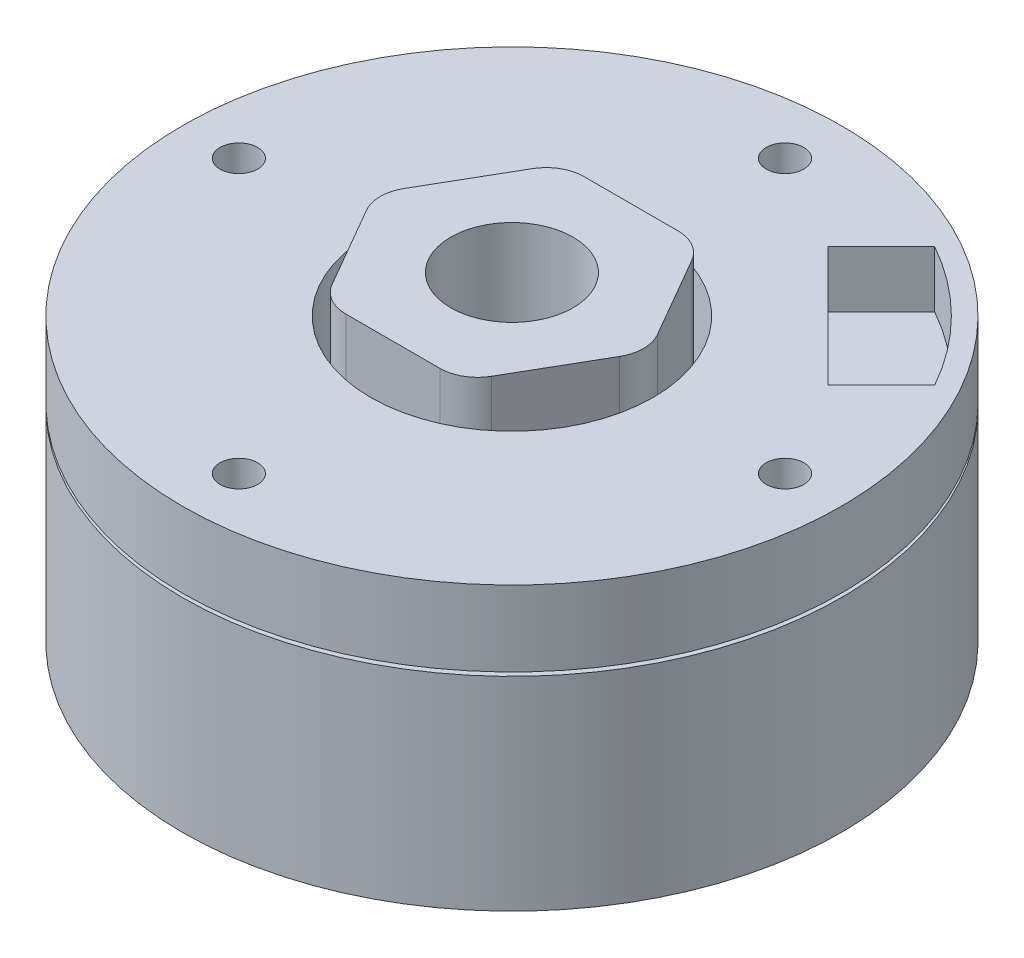
ISO-10303-21;
HEADER;
FILE_DESCRIPTION(('STEP AP214'),'2;1');
FILE_NAME('part.step','',(''),(''),'','','');
FILE_SCHEMA(('AUTOMOTIVE_DESIGN { 1 0 10303 214 1 1 1 1 }'));
ENDSEC;
DATA;
#1=APPLICATION_CONTEXT('core data for automotive mechanical design processes');
#2=APPLICATION_PROTOCOL_DEFINITION('international standard','automotive_design',2000,#1);
#3=PRODUCT_CONTEXT('',#1,'mechanical');
#4=PRODUCT('Part','Part','',(#3));
#5=PRODUCT_RELATED_PRODUCT_CATEGORY('part','',(#4));
#6=PRODUCT_DEFINITION_FORMATION('','',#4);
#7=PRODUCT_DEFINITION_CONTEXT('part definition',#1,'design');
#8=PRODUCT_DEFINITION('design','',#6,#7);
#9=PRODUCT_DEFINITION_SHAPE('','',#8);
#10=(LENGTH_UNIT() NAMED_UNIT(*) SI_UNIT(.MILLI.,.METRE.));
#11=(NAMED_UNIT(*) PLANE_ANGLE_UNIT() SI_UNIT($,.RADIAN.));
#12=(NAMED_UNIT(*) SI_UNIT($,.STERADIAN.) SOLID_ANGLE_UNIT());
#13=UNCERTAINTY_MEASURE_WITH_UNIT(LENGTH_MEASURE(1.E-05),#10,'distance_accuracy_value','');
#14=(GEOMETRIC_REPRESENTATION_CONTEXT(3) GLOBAL_UNCERTAINTY_ASSIGNED_CONTEXT((#13)) GLOBAL_UNIT_ASSIGNED_CONTEXT((#10,
#11,#12)) REPRESENTATION_CONTEXT('',''));
#15=CARTESIAN_POINT('',(0.,0.,0.));
#16=DIRECTION('',(0.,0.,1.));
#17=DIRECTION('',(1.,0.,0.));
#18=AXIS2_PLACEMENT_3D('',#15,#16,#17);
#19=CARTESIAN_POINT('',(0.,15.,0.));
#20=DIRECTION('',(0.,-1.,0.));
#21=DIRECTION('',(0.,0.,-1.));
#22=AXIS2_PLACEMENT_3D('',#19,#20,#21);
#23=CYLINDRICAL_SURFACE('',#22,17.5);
#24=CARTESIAN_POINT('',(0.,0.,0.));
#25=DIRECTION('',(0.,1.,0.));
#26=DIRECTION('',(0.,0.,1.));
#27=AXIS2_PLACEMENT_3D('',#24,#25,#26);
#28=CIRCLE('',#27,17.5);
#29=CARTESIAN_POINT('',(0.,0.,17.5));
#30=VERTEX_POINT('',#29);
#31=EDGE_CURVE('E348',#30,#30,#28,.T.);
#32=ORIENTED_EDGE('',*,*,#31,.T.);
#33=EDGE_LOOP('',(#32));
#34=FACE_BOUND('',#33,.T.);
#35=CARTESIAN_POINT('',(0.,10.8,0.));
#36=DIRECTION('',(0.,1.,0.));
#37=DIRECTION('',(0.,0.,1.));
#38=AXIS2_PLACEMENT_3D('',#35,#36,#37);
#39=CIRCLE('',#38,17.5);
#40=CARTESIAN_POINT('',(0.,10.8,17.5));
#41=VERTEX_POINT('',#40);
#42=EDGE_CURVE('E214',#41,#41,#39,.T.);
#43=ORIENTED_EDGE('',*,*,#42,.F.);
#44=EDGE_LOOP('',(#43));
#45=FACE_BOUND('',#44,.T.);
#46=ADVANCED_FACE('F42',(#34,#45),#23,.T.);
#47=CARTESIAN_POINT('',(0.,11.,0.));
#48=DIRECTION('',(0.,1.,0.));
#49=DIRECTION('',(0.,0.,1.));
#50=AXIS2_PLACEMENT_3D('',#47,#48,#49);
#51=CIRCLE('',#50,17.5);
#52=CARTESIAN_POINT('',(0.,11.,17.5));
#53=VERTEX_POINT('',#52);
#54=EDGE_CURVE('E210',#53,#53,#51,.T.);
#55=ORIENTED_EDGE('',*,*,#54,.T.);
#56=EDGE_LOOP('',(#55));
#57=FACE_BOUND('',#56,.T.);
#58=CARTESIAN_POINT('',(0.,15.,0.));
#59=DIRECTION('',(0.,1.,0.));
#60=DIRECTION('',(0.,0.,1.));
#61=AXIS2_PLACEMENT_3D('',#58,#59,#60);
#62=CIRCLE('',#61,17.5);
#63=CARTESIAN_POINT('',(0.,15.,17.5));
#64=VERTEX_POINT('',#63);
#65=EDGE_CURVE('E349',#64,#64,#62,.T.);
#66=ORIENTED_EDGE('',*,*,#65,.F.);
#67=EDGE_LOOP('',(#66));
#68=FACE_BOUND('',#67,.T.);
#69=ADVANCED_FACE('F490',(#57,#68),#23,.T.);
#70=CARTESIAN_POINT('',(0.,15.,0.));
#71=DIRECTION('',(0.,1.,0.));
#72=DIRECTION('',(0.,0.,1.));
#73=AXIS2_PLACEMENT_3D('',#70,#71,#72);
#74=PLANE('',#73);
#75=CARTESIAN_POINT('',(0.,15.,0.));
#76=DIRECTION('',(0.,1.,0.));
#77=DIRECTION('',(0.,0.,1.));
#78=AXIS2_PLACEMENT_3D('',#75,#76,#77);
#79=CIRCLE('',#78,16.5);
#80=CARTESIAN_POINT('',(14.4069526756613,15.,-8.04299164498231));
#81=VERTEX_POINT('',#80);
#82=CARTESIAN_POINT('',(8.04299164498236,15.,-14.4069526756613));
#83=VERTEX_POINT('',#82);
#84=EDGE_CURVE('E58',#81,#83,#79,.T.);
#85=ORIENTED_EDGE('',*,*,#84,.F.);
#86=DIRECTION('',(0.707106781186558,0.,-0.707106781186537));
#87=VECTOR('',#86,1.);
#88=CARTESIAN_POINT('',(11.5785255509151,15.,-5.21456452023616));
#89=LINE('',#88,#87);
#90=CARTESIAN_POINT('',(11.5785255509151,15.,-5.21456452023616));
#91=VERTEX_POINT('',#90);
#92=EDGE_CURVE('E178',#91,#81,#89,.T.);
#93=ORIENTED_EDGE('',*,*,#92,.F.);
#94=DIRECTION('',(0.707106781186546,0.,0.707106781186549));
#95=VECTOR('',#94,1.);
#96=CARTESIAN_POINT('',(5.21456452023616,15.,-11.5785255509151));
#97=LINE('',#96,#95);
#98=CARTESIAN_POINT('',(5.21456452023616,15.,-11.5785255509151));
#99=VERTEX_POINT('',#98);
#100=EDGE_CURVE('E182',#99,#91,#97,.T.);
#101=ORIENTED_EDGE('',*,*,#100,.F.);
#102=DIRECTION('',(-0.707106781186549,0.,0.707106781186546));
#103=VECTOR('',#102,1.);
#104=CARTESIAN_POINT('',(8.04299164498236,15.,-14.4069526756613));
#105=LINE('',#104,#103);
#106=EDGE_CURVE('E191',#83,#99,#105,.T.);
#107=ORIENTED_EDGE('',*,*,#106,.F.);
#108=EDGE_LOOP('',(#85,#93,#101,#107));
#109=FACE_BOUND('',#108,.T.);
#110=CARTESIAN_POINT('',(0.,15.,0.));
#111=DIRECTION('',(0.,1.,0.));
#112=DIRECTION('',(0.,0.,1.));
#113=AXIS2_PLACEMENT_3D('',#110,#111,#112);
#114=CIRCLE('',#113,7.5);
#115=CARTESIAN_POINT('',(0.,15.,7.5));
#116=VERTEX_POINT('',#115);
#117=EDGE_CURVE('E244',#116,#116,#114,.T.);
#118=ORIENTED_EDGE('',*,*,#117,.F.);
#119=EDGE_LOOP('',(#118));
#120=FACE_BOUND('',#119,.T.);
#121=CARTESIAN_POINT('',(-14.5,15.,0.));
#122=DIRECTION('',(0.,1.,0.));
#123=DIRECTION('',(1.,0.,0.));
#124=AXIS2_PLACEMENT_3D('',#121,#122,#123);
#125=CIRCLE('',#124,1.);
#126=CARTESIAN_POINT('',(-13.5,15.,0.));
#127=VERTEX_POINT('',#126);
#128=EDGE_CURVE('E253',#127,#127,#125,.T.);
#129=ORIENTED_EDGE('',*,*,#128,.F.);
#130=EDGE_LOOP('',(#129));
#131=FACE_BOUND('',#130,.T.);
#132=CARTESIAN_POINT('',(0.,15.,14.5));
#133=DIRECTION('',(0.,1.,0.));
#134=DIRECTION('',(0.,0.,-1.));
#135=AXIS2_PLACEMENT_3D('',#132,#133,#134);
#136=CIRCLE('',#135,1.);
#137=CARTESIAN_POINT('',(0.,15.,13.5));
#138=VERTEX_POINT('',#137);
#139=EDGE_CURVE('E263',#138,#138,#136,.T.);
#140=ORIENTED_EDGE('',*,*,#139,.F.);
#141=EDGE_LOOP('',(#140));
#142=FACE_BOUND('',#141,.T.);
#143=CARTESIAN_POINT('',(14.5,15.,-1.51879438239676E-13));
#144=DIRECTION('',(0.,1.,0.));
#145=DIRECTION('',(-1.,0.,0.));
#146=AXIS2_PLACEMENT_3D('',#143,#144,#145);
#147=CIRCLE('',#146,1.);
#148=CARTESIAN_POINT('',(13.5,15.,-1.41404994223147E-13));
#149=VERTEX_POINT('',#148);
#150=EDGE_CURVE('E249',#149,#149,#147,.T.);
#151=ORIENTED_EDGE('',*,*,#150,.F.);
#152=EDGE_LOOP('',(#151));
#153=FACE_BOUND('',#152,.T.);
#154=CARTESIAN_POINT('',(0.,15.,-14.5));
#155=DIRECTION('',(0.,1.,0.));
#156=DIRECTION('',(0.,0.,1.));
#157=AXIS2_PLACEMENT_3D('',#154,#155,#156);
#158=CIRCLE('',#157,1.);
#159=CARTESIAN_POINT('',(0.,15.,-13.5));
#160=VERTEX_POINT('',#159);
#161=EDGE_CURVE('E262',#160,#160,#158,.T.);
#162=ORIENTED_EDGE('',*,*,#161,.F.);
#163=EDGE_LOOP('',(#162));
#164=FACE_BOUND('',#163,.T.);
#165=ORIENTED_EDGE('',*,*,#65,.T.);
#166=EDGE_LOOP('',(#165));
#167=FACE_BOUND('',#166,.T.);
#168=ADVANCED_FACE('F496',(#109,#120,#131,#142,#153,#164,#167),#74,.T.);
#169=CARTESIAN_POINT('',(0.,0.,0.));
#170=DIRECTION('',(0.,1.,0.));
#171=DIRECTION('',(0.,0.,1.));
#172=AXIS2_PLACEMENT_3D('',#169,#170,#171);
#173=PLANE('',#172);
#174=CARTESIAN_POINT('',(9.5,0.,0.));
#175=DIRECTION('',(0.,-1.,0.));
#176=DIRECTION('',(-1.,0.,0.));
#177=AXIS2_PLACEMENT_3D('',#174,#175,#176);
#178=CIRCLE('',#177,1.);
#179=CARTESIAN_POINT('',(8.5,0.,0.));
#180=VERTEX_POINT('',#179);
#181=EDGE_CURVE('E285',#180,#180,#178,.T.);
#182=ORIENTED_EDGE('',*,*,#181,.F.);
#183=EDGE_LOOP('',(#182));
#184=FACE_BOUND('',#183,.T.);
#185=CARTESIAN_POINT('',(0.,0.,-9.5));
#186=DIRECTION('',(0.,-1.,0.));
#187=DIRECTION('',(0.,0.,1.));
#188=AXIS2_PLACEMENT_3D('',#185,#186,#187);
#189=CIRCLE('',#188,1.);
#190=CARTESIAN_POINT('',(0.,0.,-8.5));
#191=VERTEX_POINT('',#190);
#192=EDGE_CURVE('E295',#191,#191,#189,.T.);
#193=ORIENTED_EDGE('',*,*,#192,.F.);
#194=EDGE_LOOP('',(#193));
#195=FACE_BOUND('',#194,.T.);
#196=CARTESIAN_POINT('',(-9.5,0.,0.));
#197=DIRECTION('',(0.,-1.,0.));
#198=DIRECTION('',(1.,0.,0.));
#199=AXIS2_PLACEMENT_3D('',#196,#197,#198);
#200=CIRCLE('',#199,1.);
#201=CARTESIAN_POINT('',(-8.5,0.,0.));
#202=VERTEX_POINT('',#201);
#203=EDGE_CURVE('E281',#202,#202,#200,.T.);
#204=ORIENTED_EDGE('',*,*,#203,.F.);
#205=EDGE_LOOP('',(#204));
#206=FACE_BOUND('',#205,.T.);
#207=CARTESIAN_POINT('',(0.,0.,9.5));
#208=DIRECTION('',(0.,-1.,0.));
#209=DIRECTION('',(0.,0.,-1.));
#210=AXIS2_PLACEMENT_3D('',#207,#208,#209);
#211=CIRCLE('',#210,1.);
#212=CARTESIAN_POINT('',(0.,0.,8.5));
#213=VERTEX_POINT('',#212);
#214=EDGE_CURVE('E294',#213,#213,#211,.T.);
#215=ORIENTED_EDGE('',*,*,#214,.F.);
#216=EDGE_LOOP('',(#215));
#217=FACE_BOUND('',#216,.T.);
#218=CARTESIAN_POINT('',(0.,0.,0.));
#219=DIRECTION('',(0.,-1.,0.));
#220=DIRECTION('',(0.,0.,-1.));
#221=AXIS2_PLACEMENT_3D('',#218,#219,#220);
#222=CIRCLE('',#221,3.25);
#223=CARTESIAN_POINT('',(0.,0.,-3.25));
#224=VERTEX_POINT('',#223);
#225=EDGE_CURVE('E317',#224,#224,#222,.T.);
#226=ORIENTED_EDGE('',*,*,#225,.F.);
#227=EDGE_LOOP('',(#226));
#228=FACE_BOUND('',#227,.T.);
#229=ORIENTED_EDGE('',*,*,#31,.F.);
#230=EDGE_LOOP('',(#229));
#231=FACE_BOUND('',#230,.T.);
#232=ADVANCED_FACE('F501',(#184,#195,#206,#217,#228,#231),#173,.F.);
#233=CARTESIAN_POINT('',(3.65,17.,6.32198544762641));
#234=DIRECTION('',(-0.866025403784439,0.,-0.5));
#235=DIRECTION('',(-0.5,0.,0.866025403784439));
#236=AXIS2_PLACEMENT_3D('',#233,#234,#235);
#237=PLANE('',#236);
#238=DIRECTION('',(0.5,0.,-0.866025403784439));
#239=VECTOR('',#238,1.);
#240=CARTESIAN_POINT('',(3.65,10.,6.3219854476264));
#241=LINE('',#240,#239);
#242=CARTESIAN_POINT('',(4.22735026918963,10.,5.32198544762641));
#243=VERTEX_POINT('',#242);
#244=CARTESIAN_POINT('',(6.72264973081038,10.,1.));
#245=VERTEX_POINT('',#244);
#246=EDGE_CURVE('E218',#243,#245,#241,.T.);
#247=ORIENTED_EDGE('',*,*,#246,.T.);
#248=DIRECTION('',(0.,-1.,0.));
#249=VECTOR('',#248,1.);
#250=CARTESIAN_POINT('',(6.72264973081037,17.,0.999999999999999));
#251=LINE('',#250,#249);
#252=CARTESIAN_POINT('',(6.72264973081038,17.,0.999999999999998));
#253=VERTEX_POINT('',#252);
#254=EDGE_CURVE('E413',#245,#253,#251,.F.);
#255=ORIENTED_EDGE('',*,*,#254,.T.);
#256=DIRECTION('',(0.5,0.,-0.866025403784439));
#257=VECTOR('',#256,1.);
#258=CARTESIAN_POINT('',(3.65,17.,6.32198544762641));
#259=LINE('',#258,#257);
#260=CARTESIAN_POINT('',(4.22735026918962,17.,5.32198544762641));
#261=VERTEX_POINT('',#260);
#262=EDGE_CURVE('E321',#261,#253,#259,.T.);
#263=ORIENTED_EDGE('',*,*,#262,.F.);
#264=DIRECTION('',(0.,-1.,0.));
#265=VECTOR('',#264,1.);
#266=CARTESIAN_POINT('',(4.22735026918962,17.,5.32198544762641));
#267=LINE('',#266,#265);
#268=EDGE_CURVE('E409',#261,#243,#267,.T.);
#269=ORIENTED_EDGE('',*,*,#268,.T.);
#270=EDGE_LOOP('',(#247,#255,#263,#269));
#271=FACE_BOUND('',#270,.T.);
#272=ADVANCED_FACE('F479',(#271),#237,.F.);
#273=CARTESIAN_POINT('',(7.3,17.,0.));
#274=DIRECTION('',(-0.866025403784439,0.,0.5));
#275=DIRECTION('',(0.5,0.,0.866025403784439));
#276=AXIS2_PLACEMENT_3D('',#273,#274,#275);
#277=PLANE('',#276);
#278=DIRECTION('',(-0.5,0.,-0.866025403784438));
#279=VECTOR('',#278,1.);
#280=CARTESIAN_POINT('',(7.3,10.,0.));
#281=LINE('',#280,#279);
#282=CARTESIAN_POINT('',(6.72264973081038,10.,-1.));
#283=VERTEX_POINT('',#282);
#284=CARTESIAN_POINT('',(4.22735026918962,10.,-5.3219854476264));
#285=VERTEX_POINT('',#284);
#286=EDGE_CURVE('E224',#283,#285,#281,.T.);
#287=ORIENTED_EDGE('',*,*,#286,.T.);
#288=DIRECTION('',(0.,-1.,0.));
#289=VECTOR('',#288,1.);
#290=CARTESIAN_POINT('',(4.22735026918963,17.,-5.3219854476264));
#291=LINE('',#290,#289);
#292=CARTESIAN_POINT('',(4.22735026918963,17.,-5.3219854476264));
#293=VERTEX_POINT('',#292);
#294=EDGE_CURVE('E406',#285,#293,#291,.F.);
#295=ORIENTED_EDGE('',*,*,#294,.T.);
#296=DIRECTION('',(-0.5,0.,-0.866025403784439));
#297=VECTOR('',#296,1.);
#298=CARTESIAN_POINT('',(7.3,17.,0.));
#299=LINE('',#298,#297);
#300=CARTESIAN_POINT('',(6.72264973081037,17.,-1.));
#301=VERTEX_POINT('',#300);
#302=EDGE_CURVE('E328',#301,#293,#299,.T.);
#303=ORIENTED_EDGE('',*,*,#302,.F.);
#304=DIRECTION('',(0.,-1.,0.));
#305=VECTOR('',#304,1.);
#306=CARTESIAN_POINT('',(6.72264973081037,17.,-1.));
#307=LINE('',#306,#305);
#308=EDGE_CURVE('E402',#301,#283,#307,.T.);
#309=ORIENTED_EDGE('',*,*,#308,.T.);
#310=EDGE_LOOP('',(#287,#295,#303,#309));
#311=FACE_BOUND('',#310,.T.);
#312=ADVANCED_FACE('F436',(#311),#277,.F.);
#313=CARTESIAN_POINT('',(3.65,17.,-6.32198544762641));
#314=DIRECTION('',(0.,0.,1.));
#315=DIRECTION('',(1.,0.,0.));
#316=AXIS2_PLACEMENT_3D('',#313,#314,#315);
#317=PLANE('',#316);
#318=DIRECTION('',(-1.,0.,0.));
#319=VECTOR('',#318,1.);
#320=CARTESIAN_POINT('',(3.65,10.,-6.3219854476264));
#321=LINE('',#320,#319);
#322=CARTESIAN_POINT('',(2.49529946162075,10.,-6.3219854476264));
#323=VERTEX_POINT('',#322);
#324=CARTESIAN_POINT('',(-2.49529946162075,10.,-6.32198544762641));
#325=VERTEX_POINT('',#324);
#326=EDGE_CURVE('E228',#323,#325,#321,.T.);
#327=ORIENTED_EDGE('',*,*,#326,.T.);
#328=DIRECTION('',(0.,-1.,0.));
#329=VECTOR('',#328,1.);
#330=CARTESIAN_POINT('',(-2.49529946162075,17.,-6.32198544762641));
#331=LINE('',#330,#329);
#332=CARTESIAN_POINT('',(-2.49529946162075,17.,-6.32198544762641));
#333=VERTEX_POINT('',#332);
#334=EDGE_CURVE('E399',#325,#333,#331,.F.);
#335=ORIENTED_EDGE('',*,*,#334,.T.);
#336=DIRECTION('',(-1.,0.,0.));
#337=VECTOR('',#336,1.);
#338=CARTESIAN_POINT('',(3.65,17.,-6.32198544762641));
#339=LINE('',#338,#337);
#340=CARTESIAN_POINT('',(2.49529946162075,17.,-6.32198544762641));
#341=VERTEX_POINT('',#340);
#342=EDGE_CURVE('E332',#341,#333,#339,.T.);
#343=ORIENTED_EDGE('',*,*,#342,.F.);
#344=DIRECTION('',(0.,-1.,0.));
#345=VECTOR('',#344,1.);
#346=CARTESIAN_POINT('',(2.49529946162075,17.,-6.32198544762641));
#347=LINE('',#346,#345);
#348=EDGE_CURVE('E395',#341,#323,#347,.T.);
#349=ORIENTED_EDGE('',*,*,#348,.T.);
#350=EDGE_LOOP('',(#327,#335,#343,#349));
#351=FACE_BOUND('',#350,.T.);
#352=ADVANCED_FACE('F446',(#351),#317,.F.);
#353=CARTESIAN_POINT('',(-3.65,17.,-6.32198544762641));
#354=DIRECTION('',(0.866025403784439,0.,0.5));
#355=DIRECTION('',(0.5,0.,-0.866025403784439));
#356=AXIS2_PLACEMENT_3D('',#353,#354,#355);
#357=PLANE('',#356);
#358=DIRECTION('',(-0.499999999999999,0.,0.866025403784439));
#359=VECTOR('',#358,1.);
#360=CARTESIAN_POINT('',(-3.65,10.,-6.32198544762641));
#361=LINE('',#360,#359);
#362=CARTESIAN_POINT('',(-4.22735026918963,10.,-5.32198544762641));
#363=VERTEX_POINT('',#362);
#364=CARTESIAN_POINT('',(-6.72264973081037,10.,-1.));
#365=VERTEX_POINT('',#364);
#366=EDGE_CURVE('E232',#363,#365,#361,.T.);
#367=ORIENTED_EDGE('',*,*,#366,.T.);
#368=DIRECTION('',(0.,-1.,0.));
#369=VECTOR('',#368,1.);
#370=CARTESIAN_POINT('',(-6.72264973081038,17.,-1.));
#371=LINE('',#370,#369);
#372=CARTESIAN_POINT('',(-6.72264973081038,17.,-1.));
#373=VERTEX_POINT('',#372);
#374=EDGE_CURVE('E392',#365,#373,#371,.F.);
#375=ORIENTED_EDGE('',*,*,#374,.T.);
#376=DIRECTION('',(-0.5,0.,0.866025403784438));
#377=VECTOR('',#376,1.);
#378=CARTESIAN_POINT('',(-3.65,17.,-6.32198544762641));
#379=LINE('',#378,#377);
#380=CARTESIAN_POINT('',(-4.22735026918963,17.,-5.32198544762641));
#381=VERTEX_POINT('',#380);
#382=EDGE_CURVE('E336',#381,#373,#379,.T.);
#383=ORIENTED_EDGE('',*,*,#382,.F.);
#384=DIRECTION('',(0.,-1.,0.));
#385=VECTOR('',#384,1.);
#386=CARTESIAN_POINT('',(-4.22735026918963,17.,-5.32198544762641));
#387=LINE('',#386,#385);
#388=EDGE_CURVE('E388',#381,#363,#387,.T.);
#389=ORIENTED_EDGE('',*,*,#388,.T.);
#390=EDGE_LOOP('',(#367,#375,#383,#389));
#391=FACE_BOUND('',#390,.T.);
#392=ADVANCED_FACE('F454',(#391),#357,.F.);
#393=CARTESIAN_POINT('',(-7.3,17.,0.));
#394=DIRECTION('',(0.866025403784439,0.,-0.5));
#395=DIRECTION('',(-0.5,0.,-0.866025403784439));
#396=AXIS2_PLACEMENT_3D('',#393,#394,#395);
#397=PLANE('',#396);
#398=DIRECTION('',(0.5,0.,0.866025403784439));
#399=VECTOR('',#398,1.);
#400=CARTESIAN_POINT('',(-7.3,10.,0.));
#401=LINE('',#400,#399);
#402=CARTESIAN_POINT('',(-6.72264973081037,10.,0.999999999999997));
#403=VERTEX_POINT('',#402);
#404=CARTESIAN_POINT('',(-4.22735026918962,10.,5.3219854476264));
#405=VERTEX_POINT('',#404);
#406=EDGE_CURVE('E236',#403,#405,#401,.T.);
#407=ORIENTED_EDGE('',*,*,#406,.T.);
#408=DIRECTION('',(0.,-1.,0.));
#409=VECTOR('',#408,1.);
#410=CARTESIAN_POINT('',(-4.22735026918963,17.,5.3219854476264));
#411=LINE('',#410,#409);
#412=CARTESIAN_POINT('',(-4.22735026918963,17.,5.3219854476264));
#413=VERTEX_POINT('',#412);
#414=EDGE_CURVE('E367',#405,#413,#411,.F.);
#415=ORIENTED_EDGE('',*,*,#414,.T.);
#416=DIRECTION('',(0.5,0.,0.866025403784439));
#417=VECTOR('',#416,1.);
#418=CARTESIAN_POINT('',(-7.3,17.,0.));
#419=LINE('',#418,#417);
#420=CARTESIAN_POINT('',(-6.72264973081038,17.,0.999999999999998));
#421=VERTEX_POINT('',#420);
#422=EDGE_CURVE('E340',#421,#413,#419,.T.);
#423=ORIENTED_EDGE('',*,*,#422,.F.);
#424=DIRECTION('',(0.,-1.,0.));
#425=VECTOR('',#424,1.);
#426=CARTESIAN_POINT('',(-6.72264973081038,17.,0.999999999999999));
#427=LINE('',#426,#425);
#428=EDGE_CURVE('E363',#421,#403,#427,.T.);
#429=ORIENTED_EDGE('',*,*,#428,.T.);
#430=EDGE_LOOP('',(#407,#415,#423,#429));
#431=FACE_BOUND('',#430,.T.);
#432=ADVANCED_FACE('F463',(#431),#397,.F.);
#433=CARTESIAN_POINT('',(-3.65,17.,6.3219854476264));
#434=DIRECTION('',(0.,0.,-1.));
#435=DIRECTION('',(-1.,0.,0.));
#436=AXIS2_PLACEMENT_3D('',#433,#434,#435);
#437=PLANE('',#436);
#438=DIRECTION('',(1.,0.,0.));
#439=VECTOR('',#438,1.);
#440=CARTESIAN_POINT('',(-3.65,17.,6.3219854476264));
#441=LINE('',#440,#439);
#442=CARTESIAN_POINT('',(-2.49529946162075,17.,6.3219854476264));
#443=VERTEX_POINT('',#442);
#444=CARTESIAN_POINT('',(2.49529946162075,17.,6.32198544762641));
#445=VERTEX_POINT('',#444);
#446=EDGE_CURVE('E344',#443,#445,#441,.T.);
#447=ORIENTED_EDGE('',*,*,#446,.F.);
#448=DIRECTION('',(0.,-1.,0.));
#449=VECTOR('',#448,1.);
#450=CARTESIAN_POINT('',(-2.49529946162075,17.,6.3219854476264));
#451=LINE('',#450,#449);
#452=CARTESIAN_POINT('',(-2.49529946162075,10.,6.3219854476264));
#453=VERTEX_POINT('',#452);
#454=EDGE_CURVE('E359',#443,#453,#451,.T.);
#455=ORIENTED_EDGE('',*,*,#454,.T.);
#456=DIRECTION('',(1.,0.,0.));
#457=VECTOR('',#456,1.);
#458=CARTESIAN_POINT('',(-3.65,10.,6.3219854476264));
#459=LINE('',#458,#457);
#460=CARTESIAN_POINT('',(2.49529946162075,10.,6.3219854476264));
#461=VERTEX_POINT('',#460);
#462=EDGE_CURVE('E240',#453,#461,#459,.T.);
#463=ORIENTED_EDGE('',*,*,#462,.T.);
#464=DIRECTION('',(0.,-1.,0.));
#465=VECTOR('',#464,1.);
#466=CARTESIAN_POINT('',(2.49529946162075,17.,6.32198544762641));
#467=LINE('',#466,#465);
#468=EDGE_CURVE('E353',#461,#445,#467,.F.);
#469=ORIENTED_EDGE('',*,*,#468,.T.);
#470=EDGE_LOOP('',(#447,#455,#463,#469));
#471=FACE_BOUND('',#470,.T.);
#472=ADVANCED_FACE('F472',(#471),#437,.F.);
#473=CARTESIAN_POINT('',(0.,17.,0.));
#474=DIRECTION('',(0.,1.,0.));
#475=DIRECTION('',(0.,0.,1.));
#476=AXIS2_PLACEMENT_3D('',#473,#474,#475);
#477=PLANE('',#476);
#478=CARTESIAN_POINT('',(0.,17.,0.));
#479=DIRECTION('',(0.,1.,0.));
#480=DIRECTION('',(0.,0.,1.));
#481=AXIS2_PLACEMENT_3D('',#478,#479,#480);
#482=CIRCLE('',#481,3.25);
#483=CARTESIAN_POINT('',(0.,17.,3.25));
#484=VERTEX_POINT('',#483);
#485=EDGE_CURVE('E313',#484,#484,#482,.F.);
#486=ORIENTED_EDGE('',*,*,#485,.T.);
#487=EDGE_LOOP('',(#486));
#488=FACE_BOUND('',#487,.T.);
#489=ORIENTED_EDGE('',*,*,#422,.T.);
#490=CARTESIAN_POINT('',(-2.49529946162075,17.,4.3219854476264));
#491=DIRECTION('',(0.,1.,0.));
#492=DIRECTION('',(0.,0.,1.));
#493=AXIS2_PLACEMENT_3D('',#490,#491,#492);
#494=CIRCLE('',#493,2.);
#495=EDGE_CURVE('E385',#413,#443,#494,.T.);
#496=ORIENTED_EDGE('',*,*,#495,.T.);
#497=ORIENTED_EDGE('',*,*,#446,.T.);
#498=CARTESIAN_POINT('',(2.49529946162075,17.,4.32198544762641));
#499=DIRECTION('',(0.,1.,0.));
#500=DIRECTION('',(0.,0.,1.));
#501=AXIS2_PLACEMENT_3D('',#498,#499,#500);
#502=CIRCLE('',#501,2.);
#503=EDGE_CURVE('E370',#445,#261,#502,.T.);
#504=ORIENTED_EDGE('',*,*,#503,.T.);
#505=ORIENTED_EDGE('',*,*,#262,.T.);
#506=CARTESIAN_POINT('',(4.9905989232415,17.,0.));
#507=DIRECTION('',(0.,1.,0.));
#508=DIRECTION('',(0.,0.,1.));
#509=AXIS2_PLACEMENT_3D('',#506,#507,#508);
#510=CIRCLE('',#509,2.);
#511=EDGE_CURVE('E373',#253,#301,#510,.T.);
#512=ORIENTED_EDGE('',*,*,#511,.T.);
#513=ORIENTED_EDGE('',*,*,#302,.T.);
#514=CARTESIAN_POINT('',(2.49529946162075,17.,-4.32198544762641));
#515=DIRECTION('',(0.,1.,0.));
#516=DIRECTION('',(0.,0.,1.));
#517=AXIS2_PLACEMENT_3D('',#514,#515,#516);
#518=CIRCLE('',#517,2.);
#519=EDGE_CURVE('E376',#293,#341,#518,.T.);
#520=ORIENTED_EDGE('',*,*,#519,.T.);
#521=ORIENTED_EDGE('',*,*,#342,.T.);
#522=CARTESIAN_POINT('',(-2.49529946162075,17.,-4.32198544762641));
#523=DIRECTION('',(0.,1.,0.));
#524=DIRECTION('',(0.,0.,1.));
#525=AXIS2_PLACEMENT_3D('',#522,#523,#524);
#526=CIRCLE('',#525,2.);
#527=EDGE_CURVE('E379',#333,#381,#526,.T.);
#528=ORIENTED_EDGE('',*,*,#527,.T.);
#529=ORIENTED_EDGE('',*,*,#382,.T.);
#530=CARTESIAN_POINT('',(-4.9905989232415,17.,0.));
#531=DIRECTION('',(0.,1.,0.));
#532=DIRECTION('',(0.,0.,1.));
#533=AXIS2_PLACEMENT_3D('',#530,#531,#532);
#534=CIRCLE('',#533,2.);
#535=EDGE_CURVE('E382',#373,#421,#534,.T.);
#536=ORIENTED_EDGE('',*,*,#535,.T.);
#537=EDGE_LOOP('',(#489,#496,#497,#504,#505,#512,#513,#520,#521,#528,#529,#536));
#538=FACE_BOUND('',#537,.T.);
#539=ADVANCED_FACE('F443',(#488,#538),#477,.T.);
#540=CARTESIAN_POINT('',(0.,17.001,0.));
#541=DIRECTION('',(0.,-1.,0.));
#542=DIRECTION('',(0.,0.,-1.));
#543=AXIS2_PLACEMENT_3D('',#540,#541,#542);
#544=CYLINDRICAL_SURFACE('',#543,3.25);
#545=ORIENTED_EDGE('',*,*,#485,.F.);
#546=EDGE_LOOP('',(#545));
#547=FACE_BOUND('',#546,.T.);
#548=ORIENTED_EDGE('',*,*,#225,.T.);
#549=EDGE_LOOP('',(#548));
#550=FACE_BOUND('',#549,.T.);
#551=ADVANCED_FACE('F823',(#547,#550),#544,.F.);
#552=CARTESIAN_POINT('',(0.,5.,9.5));
#553=DIRECTION('',(0.,-1.,0.));
#554=DIRECTION('',(0.,0.,-1.));
#555=AXIS2_PLACEMENT_3D('',#552,#553,#554);
#556=CYLINDRICAL_SURFACE('',#555,1.);
#557=CARTESIAN_POINT('',(0.,5.,9.5));
#558=DIRECTION('',(0.,-1.,0.));
#559=DIRECTION('',(0.,0.,-1.));
#560=AXIS2_PLACEMENT_3D('',#557,#558,#559);
#561=CIRCLE('',#560,1.);
#562=CARTESIAN_POINT('',(0.,5.,8.5));
#563=VERTEX_POINT('',#562);
#564=EDGE_CURVE('E309',#563,#563,#561,.T.);
#565=ORIENTED_EDGE('',*,*,#564,.F.);
#566=EDGE_LOOP('',(#565));
#567=FACE_BOUND('',#566,.T.);
#568=ORIENTED_EDGE('',*,*,#214,.T.);
#569=EDGE_LOOP('',(#568));
#570=FACE_BOUND('',#569,.T.);
#571=ADVANCED_FACE('F813',(#567,#570),#556,.F.);
#572=CARTESIAN_POINT('',(0.,5.,9.5));
#573=DIRECTION('',(0.,-1.,0.));
#574=DIRECTION('',(0.,0.,-1.));
#575=AXIS2_PLACEMENT_3D('',#572,#573,#574);
#576=PLANE('',#575);
#577=ORIENTED_EDGE('',*,*,#564,.T.);
#578=EDGE_LOOP('',(#577));
#579=FACE_BOUND('',#578,.T.);
#580=ADVANCED_FACE('F767',(#579),#576,.T.);
#581=CARTESIAN_POINT('',(-9.5,5.,0.));
#582=DIRECTION('',(0.,-1.,0.));
#583=DIRECTION('',(1.,0.,0.));
#584=AXIS2_PLACEMENT_3D('',#581,#582,#583);
#585=CYLINDRICAL_SURFACE('',#584,1.);
#586=CARTESIAN_POINT('',(-9.5,5.,0.));
#587=DIRECTION('',(0.,-1.,0.));
#588=DIRECTION('',(1.,0.,0.));
#589=AXIS2_PLACEMENT_3D('',#586,#587,#588);
#590=CIRCLE('',#589,1.);
#591=CARTESIAN_POINT('',(-8.5,5.,0.));
#592=VERTEX_POINT('',#591);
#593=EDGE_CURVE('E299',#592,#592,#590,.T.);
#594=ORIENTED_EDGE('',*,*,#593,.F.);
#595=EDGE_LOOP('',(#594));
#596=FACE_BOUND('',#595,.T.);
#597=ORIENTED_EDGE('',*,*,#203,.T.);
#598=EDGE_LOOP('',(#597));
#599=FACE_BOUND('',#598,.T.);
#600=ADVANCED_FACE('F756',(#596,#599),#585,.F.);
#601=CARTESIAN_POINT('',(-9.5,5.,0.));
#602=DIRECTION('',(0.,-1.,0.));
#603=DIRECTION('',(1.,0.,0.));
#604=AXIS2_PLACEMENT_3D('',#601,#602,#603);
#605=PLANE('',#604);
#606=ORIENTED_EDGE('',*,*,#593,.T.);
#607=EDGE_LOOP('',(#606));
#608=FACE_BOUND('',#607,.T.);
#609=ADVANCED_FACE('F750',(#608),#605,.T.);
#610=CARTESIAN_POINT('',(0.,5.,-9.5));
#611=DIRECTION('',(0.,-1.,0.));
#612=DIRECTION('',(0.,0.,1.));
#613=AXIS2_PLACEMENT_3D('',#610,#611,#612);
#614=CYLINDRICAL_SURFACE('',#613,1.);
#615=CARTESIAN_POINT('',(0.,5.,-9.5));
#616=DIRECTION('',(0.,-1.,0.));
#617=DIRECTION('',(0.,0.,1.));
#618=AXIS2_PLACEMENT_3D('',#615,#616,#617);
#619=CIRCLE('',#618,1.);
#620=CARTESIAN_POINT('',(0.,5.,-8.5));
#621=VERTEX_POINT('',#620);
#622=EDGE_CURVE('E290',#621,#621,#619,.T.);
#623=ORIENTED_EDGE('',*,*,#622,.F.);
#624=EDGE_LOOP('',(#623));
#625=FACE_BOUND('',#624,.T.);
#626=ORIENTED_EDGE('',*,*,#192,.T.);
#627=EDGE_LOOP('',(#626));
#628=FACE_BOUND('',#627,.T.);
#629=ADVANCED_FACE('F755',(#625,#628),#614,.F.);
#630=CARTESIAN_POINT('',(0.,5.,-9.5));
#631=DIRECTION('',(0.,-1.,0.));
#632=DIRECTION('',(0.,0.,1.));
#633=AXIS2_PLACEMENT_3D('',#630,#631,#632);
#634=PLANE('',#633);
#635=ORIENTED_EDGE('',*,*,#622,.T.);
#636=EDGE_LOOP('',(#635));
#637=FACE_BOUND('',#636,.T.);
#638=ADVANCED_FACE('F774',(#637),#634,.T.);
#639=CARTESIAN_POINT('',(9.5,5.,0.));
#640=DIRECTION('',(0.,-1.,0.));
#641=DIRECTION('',(-1.,0.,0.));
#642=AXIS2_PLACEMENT_3D('',#639,#640,#641);
#643=CYLINDRICAL_SURFACE('',#642,1.);
#644=CARTESIAN_POINT('',(9.5,5.,0.));
#645=DIRECTION('',(0.,-1.,0.));
#646=DIRECTION('',(-1.,0.,0.));
#647=AXIS2_PLACEMENT_3D('',#644,#645,#646);
#648=CIRCLE('',#647,1.);
#649=CARTESIAN_POINT('',(8.5,5.,0.));
#650=VERTEX_POINT('',#649);
#651=EDGE_CURVE('E289',#650,#650,#648,.T.);
#652=ORIENTED_EDGE('',*,*,#651,.F.);
#653=EDGE_LOOP('',(#652));
#654=FACE_BOUND('',#653,.T.);
#655=ORIENTED_EDGE('',*,*,#181,.T.);
#656=EDGE_LOOP('',(#655));
#657=FACE_BOUND('',#656,.T.);
#658=ADVANCED_FACE('F779',(#654,#657),#643,.F.);
#659=CARTESIAN_POINT('',(9.5,5.,0.));
#660=DIRECTION('',(0.,-1.,0.));
#661=DIRECTION('',(-1.,0.,0.));
#662=AXIS2_PLACEMENT_3D('',#659,#660,#661);
#663=PLANE('',#662);
#664=ORIENTED_EDGE('',*,*,#651,.T.);
#665=EDGE_LOOP('',(#664));
#666=FACE_BOUND('',#665,.T.);
#667=ADVANCED_FACE('F743',(#666),#663,.T.);
#668=CARTESIAN_POINT('',(0.,13.,-14.5));
#669=DIRECTION('',(0.,1.,0.));
#670=DIRECTION('',(0.,0.,1.));
#671=AXIS2_PLACEMENT_3D('',#668,#669,#670);
#672=CYLINDRICAL_SURFACE('',#671,1.);
#673=CARTESIAN_POINT('',(0.,13.,-14.5));
#674=DIRECTION('',(0.,1.,0.));
#675=DIRECTION('',(0.,0.,1.));
#676=AXIS2_PLACEMENT_3D('',#673,#674,#675);
#677=CIRCLE('',#676,1.);
#678=CARTESIAN_POINT('',(0.,13.,-13.5));
#679=VERTEX_POINT('',#678);
#680=EDGE_CURVE('E277',#679,#679,#677,.T.);
#681=ORIENTED_EDGE('',*,*,#680,.F.);
#682=EDGE_LOOP('',(#681));
#683=FACE_BOUND('',#682,.T.);
#684=ORIENTED_EDGE('',*,*,#161,.T.);
#685=EDGE_LOOP('',(#684));
#686=FACE_BOUND('',#685,.T.);
#687=ADVANCED_FACE('F733',(#683,#686),#672,.F.);
#688=CARTESIAN_POINT('',(0.,13.,-14.5));
#689=DIRECTION('',(0.,1.,0.));
#690=DIRECTION('',(0.,0.,1.));
#691=AXIS2_PLACEMENT_3D('',#688,#689,#690);
#692=PLANE('',#691);
#693=ORIENTED_EDGE('',*,*,#680,.T.);
#694=EDGE_LOOP('',(#693));
#695=FACE_BOUND('',#694,.T.);
#696=ADVANCED_FACE('F685',(#695),#692,.T.);
#697=CARTESIAN_POINT('',(14.5,13.,-1.51879438239676E-13));
#698=DIRECTION('',(0.,1.,0.));
#699=DIRECTION('',(-1.,0.,0.));
#700=AXIS2_PLACEMENT_3D('',#697,#698,#699);
#701=CYLINDRICAL_SURFACE('',#700,1.);
#702=CARTESIAN_POINT('',(14.5,13.,-1.51879438239676E-13));
#703=DIRECTION('',(0.,1.,0.));
#704=DIRECTION('',(-1.,0.,0.));
#705=AXIS2_PLACEMENT_3D('',#702,#703,#704);
#706=CIRCLE('',#705,1.);
#707=CARTESIAN_POINT('',(13.5,13.,-1.41404994223147E-13));
#708=VERTEX_POINT('',#707);
#709=EDGE_CURVE('E267',#708,#708,#706,.T.);
#710=ORIENTED_EDGE('',*,*,#709,.F.);
#711=EDGE_LOOP('',(#710));
#712=FACE_BOUND('',#711,.T.);
#713=ORIENTED_EDGE('',*,*,#150,.T.);
#714=EDGE_LOOP('',(#713));
#715=FACE_BOUND('',#714,.T.);
#716=ADVANCED_FACE('F674',(#712,#715),#701,.F.);
#717=CARTESIAN_POINT('',(14.5,13.,-1.51879438239676E-13));
#718=DIRECTION('',(0.,1.,0.));
#719=DIRECTION('',(-1.,0.,0.));
#720=AXIS2_PLACEMENT_3D('',#717,#718,#719);
#721=PLANE('',#720);
#722=ORIENTED_EDGE('',*,*,#709,.T.);
#723=EDGE_LOOP('',(#722));
#724=FACE_BOUND('',#723,.T.);
#725=ADVANCED_FACE('F668',(#724),#721,.T.);
#726=CARTESIAN_POINT('',(0.,13.,14.5));
#727=DIRECTION('',(0.,1.,0.));
#728=DIRECTION('',(0.,0.,-1.));
#729=AXIS2_PLACEMENT_3D('',#726,#727,#728);
#730=CYLINDRICAL_SURFACE('',#729,1.);
#731=CARTESIAN_POINT('',(0.,13.,14.5));
#732=DIRECTION('',(0.,1.,0.));
#733=DIRECTION('',(0.,0.,-1.));
#734=AXIS2_PLACEMENT_3D('',#731,#732,#733);
#735=CIRCLE('',#734,1.);
#736=CARTESIAN_POINT('',(0.,13.,13.5));
#737=VERTEX_POINT('',#736);
#738=EDGE_CURVE('E258',#737,#737,#735,.T.);
#739=ORIENTED_EDGE('',*,*,#738,.F.);
#740=EDGE_LOOP('',(#739));
#741=FACE_BOUND('',#740,.T.);
#742=ORIENTED_EDGE('',*,*,#139,.T.);
#743=EDGE_LOOP('',(#742));
#744=FACE_BOUND('',#743,.T.);
#745=ADVANCED_FACE('F673',(#741,#744),#730,.F.);
#746=CARTESIAN_POINT('',(0.,13.,14.5));
#747=DIRECTION('',(0.,1.,0.));
#748=DIRECTION('',(0.,0.,-1.));
#749=AXIS2_PLACEMENT_3D('',#746,#747,#748);
#750=PLANE('',#749);
#751=ORIENTED_EDGE('',*,*,#738,.T.);
#752=EDGE_LOOP('',(#751));
#753=FACE_BOUND('',#752,.T.);
#754=ADVANCED_FACE('F692',(#753),#750,.T.);
#755=CARTESIAN_POINT('',(-14.5,13.,0.));
#756=DIRECTION('',(0.,1.,0.));
#757=DIRECTION('',(1.,0.,0.));
#758=AXIS2_PLACEMENT_3D('',#755,#756,#757);
#759=CYLINDRICAL_SURFACE('',#758,1.);
#760=CARTESIAN_POINT('',(-14.5,13.,0.));
#761=DIRECTION('',(0.,1.,0.));
#762=DIRECTION('',(1.,0.,0.));
#763=AXIS2_PLACEMENT_3D('',#760,#761,#762);
#764=CIRCLE('',#763,1.);
#765=CARTESIAN_POINT('',(-13.5,13.,0.));
#766=VERTEX_POINT('',#765);
#767=EDGE_CURVE('E257',#766,#766,#764,.T.);
#768=ORIENTED_EDGE('',*,*,#767,.F.);
#769=EDGE_LOOP('',(#768));
#770=FACE_BOUND('',#769,.T.);
#771=ORIENTED_EDGE('',*,*,#128,.T.);
#772=EDGE_LOOP('',(#771));
#773=FACE_BOUND('',#772,.T.);
#774=ADVANCED_FACE('F697',(#770,#773),#759,.F.);
#775=CARTESIAN_POINT('',(-14.5,13.,0.));
#776=DIRECTION('',(0.,1.,0.));
#777=DIRECTION('',(1.,0.,0.));
#778=AXIS2_PLACEMENT_3D('',#775,#776,#777);
#779=PLANE('',#778);
#780=ORIENTED_EDGE('',*,*,#767,.T.);
#781=EDGE_LOOP('',(#780));
#782=FACE_BOUND('',#781,.T.);
#783=ADVANCED_FACE('F661',(#782),#779,.T.);
#784=CARTESIAN_POINT('',(0.,10.,0.));
#785=DIRECTION('',(0.,1.,0.));
#786=DIRECTION('',(0.,0.,1.));
#787=AXIS2_PLACEMENT_3D('',#784,#785,#786);
#788=CYLINDRICAL_SURFACE('',#787,7.5);
#789=CARTESIAN_POINT('',(0.,10.,0.));
#790=DIRECTION('',(0.,1.,0.));
#791=DIRECTION('',(0.,0.,1.));
#792=AXIS2_PLACEMENT_3D('',#789,#790,#791);
#793=CIRCLE('',#792,7.5);
#794=CARTESIAN_POINT('',(0.,10.,7.5));
#795=VERTEX_POINT('',#794);
#796=EDGE_CURVE('E245',#795,#795,#793,.T.);
#797=ORIENTED_EDGE('',*,*,#796,.F.);
#798=EDGE_LOOP('',(#797));
#799=FACE_BOUND('',#798,.T.);
#800=ORIENTED_EDGE('',*,*,#117,.T.);
#801=EDGE_LOOP('',(#800));
#802=FACE_BOUND('',#801,.T.);
#803=ADVANCED_FACE('F652',(#799,#802),#788,.F.);
#804=CARTESIAN_POINT('',(0.,10.,0.));
#805=DIRECTION('',(0.,1.,0.));
#806=DIRECTION('',(0.,0.,1.));
#807=AXIS2_PLACEMENT_3D('',#804,#805,#806);
#808=PLANE('',#807);
#809=ORIENTED_EDGE('',*,*,#462,.F.);
#810=CARTESIAN_POINT('',(-2.49529946162075,10.,4.3219854476264));
#811=DIRECTION('',(0.,1.,0.));
#812=DIRECTION('',(0.,0.,1.));
#813=AXIS2_PLACEMENT_3D('',#810,#811,#812);
#814=CIRCLE('',#813,2.);
#815=EDGE_CURVE('E416',#453,#405,#814,.F.);
#816=ORIENTED_EDGE('',*,*,#815,.T.);
#817=ORIENTED_EDGE('',*,*,#406,.F.);
#818=CARTESIAN_POINT('',(-4.9905989232415,10.,0.));
#819=DIRECTION('',(0.,1.,0.));
#820=DIRECTION('',(0.,0.,1.));
#821=AXIS2_PLACEMENT_3D('',#818,#819,#820);
#822=CIRCLE('',#821,2.);
#823=EDGE_CURVE('E419',#403,#365,#822,.F.);
#824=ORIENTED_EDGE('',*,*,#823,.T.);
#825=ORIENTED_EDGE('',*,*,#366,.F.);
#826=CARTESIAN_POINT('',(-2.49529946162075,10.,-4.32198544762641));
#827=DIRECTION('',(0.,1.,0.));
#828=DIRECTION('',(0.,0.,1.));
#829=AXIS2_PLACEMENT_3D('',#826,#827,#828);
#830=CIRCLE('',#829,2.);
#831=EDGE_CURVE('E422',#363,#325,#830,.F.);
#832=ORIENTED_EDGE('',*,*,#831,.T.);
#833=ORIENTED_EDGE('',*,*,#326,.F.);
#834=CARTESIAN_POINT('',(2.49529946162075,10.,-4.32198544762641));
#835=DIRECTION('',(0.,1.,0.));
#836=DIRECTION('',(0.,0.,1.));
#837=AXIS2_PLACEMENT_3D('',#834,#835,#836);
#838=CIRCLE('',#837,2.);
#839=EDGE_CURVE('E425',#323,#285,#838,.F.);
#840=ORIENTED_EDGE('',*,*,#839,.T.);
#841=ORIENTED_EDGE('',*,*,#286,.F.);
#842=CARTESIAN_POINT('',(4.9905989232415,10.,0.));
#843=DIRECTION('',(0.,1.,0.));
#844=DIRECTION('',(0.,0.,1.));
#845=AXIS2_PLACEMENT_3D('',#842,#843,#844);
#846=CIRCLE('',#845,2.);
#847=EDGE_CURVE('E51',#283,#245,#846,.F.);
#848=ORIENTED_EDGE('',*,*,#847,.T.);
#849=ORIENTED_EDGE('',*,*,#246,.F.);
#850=CARTESIAN_POINT('',(2.49529946162075,10.,4.32198544762641));
#851=DIRECTION('',(0.,1.,0.));
#852=DIRECTION('',(0.,0.,1.));
#853=AXIS2_PLACEMENT_3D('',#850,#851,#852);
#854=CIRCLE('',#853,2.);
#855=EDGE_CURVE('E11',#243,#461,#854,.F.);
#856=ORIENTED_EDGE('',*,*,#855,.T.);
#857=EDGE_LOOP('',(#809,#816,#817,#824,#825,#832,#833,#840,#841,#848,#849,#856));
#858=FACE_BOUND('',#857,.T.);
#859=ORIENTED_EDGE('',*,*,#796,.T.);
#860=EDGE_LOOP('',(#859));
#861=FACE_BOUND('',#860,.T.);
#862=ADVANCED_FACE('F430',(#858,#861),#808,.T.);
#863=CARTESIAN_POINT('',(0.,10.8,0.));
#864=DIRECTION('',(0.,1.,0.));
#865=DIRECTION('',(0.,0.,1.));
#866=AXIS2_PLACEMENT_3D('',#863,#864,#865);
#867=PLANE('',#866);
#868=CARTESIAN_POINT('',(0.,10.8,0.));
#869=DIRECTION('',(0.,1.,0.));
#870=DIRECTION('',(0.,0.,1.));
#871=AXIS2_PLACEMENT_3D('',#868,#869,#870);
#872=CIRCLE('',#871,12.5);
#873=CARTESIAN_POINT('',(0.,10.8,12.5));
#874=VERTEX_POINT('',#873);
#875=EDGE_CURVE('E206',#874,#874,#872,.T.);
#876=ORIENTED_EDGE('',*,*,#875,.F.);
#877=EDGE_LOOP('',(#876));
#878=FACE_BOUND('',#877,.T.);
#879=ORIENTED_EDGE('',*,*,#42,.T.);
#880=EDGE_LOOP('',(#879));
#881=FACE_BOUND('',#880,.T.);
#882=ADVANCED_FACE('F628',(#878,#881),#867,.T.);
#883=CARTESIAN_POINT('',(0.,11.,0.));
#884=DIRECTION('',(0.,1.,0.));
#885=DIRECTION('',(0.,0.,1.));
#886=AXIS2_PLACEMENT_3D('',#883,#884,#885);
#887=PLANE('',#886);
#888=CARTESIAN_POINT('',(0.,11.,0.));
#889=DIRECTION('',(0.,1.,0.));
#890=DIRECTION('',(0.,0.,1.));
#891=AXIS2_PLACEMENT_3D('',#888,#889,#890);
#892=CIRCLE('',#891,12.5);
#893=CARTESIAN_POINT('',(0.,11.,12.5));
#894=VERTEX_POINT('',#893);
#895=EDGE_CURVE('E200',#894,#894,#892,.T.);
#896=ORIENTED_EDGE('',*,*,#895,.T.);
#897=EDGE_LOOP('',(#896));
#898=FACE_BOUND('',#897,.T.);
#899=ORIENTED_EDGE('',*,*,#54,.F.);
#900=EDGE_LOOP('',(#899));
#901=FACE_BOUND('',#900,.T.);
#902=ADVANCED_FACE('F618',(#898,#901),#887,.F.);
#903=CARTESIAN_POINT('',(0.,10.8,0.));
#904=DIRECTION('',(0.,1.,0.));
#905=DIRECTION('',(0.,0.,1.));
#906=AXIS2_PLACEMENT_3D('',#903,#904,#905);
#907=CYLINDRICAL_SURFACE('',#906,12.5);
#908=ORIENTED_EDGE('',*,*,#875,.T.);
#909=EDGE_LOOP('',(#908));
#910=FACE_BOUND('',#909,.T.);
#911=ORIENTED_EDGE('',*,*,#895,.F.);
#912=EDGE_LOOP('',(#911));
#913=FACE_BOUND('',#912,.T.);
#914=ADVANCED_FACE('F505',(#910,#913),#907,.T.);
#915=CARTESIAN_POINT('',(-2.49529946162075,17.,4.3219854476264));
#916=DIRECTION('',(0.,-1.,0.));
#917=DIRECTION('',(0.,0.,-1.));
#918=AXIS2_PLACEMENT_3D('',#915,#916,#917);
#919=CYLINDRICAL_SURFACE('',#918,2.);
#920=ORIENTED_EDGE('',*,*,#495,.F.);
#921=ORIENTED_EDGE('',*,*,#414,.F.);
#922=ORIENTED_EDGE('',*,*,#815,.F.);
#923=ORIENTED_EDGE('',*,*,#454,.F.);
#924=EDGE_LOOP('',(#920,#921,#922,#923));
#925=FACE_BOUND('',#924,.T.);
#926=ADVANCED_FACE('F467',(#925),#919,.T.);
#927=CARTESIAN_POINT('',(-4.9905989232415,17.,0.));
#928=DIRECTION('',(0.,-1.,0.));
#929=DIRECTION('',(0.,0.,-1.));
#930=AXIS2_PLACEMENT_3D('',#927,#928,#929);
#931=CYLINDRICAL_SURFACE('',#930,2.);
#932=ORIENTED_EDGE('',*,*,#535,.F.);
#933=ORIENTED_EDGE('',*,*,#374,.F.);
#934=ORIENTED_EDGE('',*,*,#823,.F.);
#935=ORIENTED_EDGE('',*,*,#428,.F.);
#936=EDGE_LOOP('',(#932,#933,#934,#935));
#937=FACE_BOUND('',#936,.T.);
#938=ADVANCED_FACE('F458',(#937),#931,.T.);
#939=CARTESIAN_POINT('',(-2.49529946162075,17.,-4.32198544762641));
#940=DIRECTION('',(0.,-1.,0.));
#941=DIRECTION('',(0.,0.,-1.));
#942=AXIS2_PLACEMENT_3D('',#939,#940,#941);
#943=CYLINDRICAL_SURFACE('',#942,2.);
#944=ORIENTED_EDGE('',*,*,#527,.F.);
#945=ORIENTED_EDGE('',*,*,#334,.F.);
#946=ORIENTED_EDGE('',*,*,#831,.F.);
#947=ORIENTED_EDGE('',*,*,#388,.F.);
#948=EDGE_LOOP('',(#944,#945,#946,#947));
#949=FACE_BOUND('',#948,.T.);
#950=ADVANCED_FACE('F449',(#949),#943,.T.);
#951=CARTESIAN_POINT('',(2.49529946162075,17.,-4.32198544762641));
#952=DIRECTION('',(0.,-1.,0.));
#953=DIRECTION('',(0.,0.,-1.));
#954=AXIS2_PLACEMENT_3D('',#951,#952,#953);
#955=CYLINDRICAL_SURFACE('',#954,2.);
#956=ORIENTED_EDGE('',*,*,#519,.F.);
#957=ORIENTED_EDGE('',*,*,#294,.F.);
#958=ORIENTED_EDGE('',*,*,#839,.F.);
#959=ORIENTED_EDGE('',*,*,#348,.F.);
#960=EDGE_LOOP('',(#956,#957,#958,#959));
#961=FACE_BOUND('',#960,.T.);
#962=ADVANCED_FACE('F440',(#961),#955,.T.);
#963=CARTESIAN_POINT('',(4.9905989232415,17.,0.));
#964=DIRECTION('',(0.,-1.,0.));
#965=DIRECTION('',(0.,0.,-1.));
#966=AXIS2_PLACEMENT_3D('',#963,#964,#965);
#967=CYLINDRICAL_SURFACE('',#966,2.);
#968=ORIENTED_EDGE('',*,*,#511,.F.);
#969=ORIENTED_EDGE('',*,*,#254,.F.);
#970=ORIENTED_EDGE('',*,*,#847,.F.);
#971=ORIENTED_EDGE('',*,*,#308,.F.);
#972=EDGE_LOOP('',(#968,#969,#970,#971));
#973=FACE_BOUND('',#972,.T.);
#974=ADVANCED_FACE('F482',(#973),#967,.T.);
#975=CARTESIAN_POINT('',(2.49529946162075,17.,4.32198544762641));
#976=DIRECTION('',(0.,-1.,0.));
#977=DIRECTION('',(0.,0.,-1.));
#978=AXIS2_PLACEMENT_3D('',#975,#976,#977);
#979=CYLINDRICAL_SURFACE('',#978,2.);
#980=ORIENTED_EDGE('',*,*,#503,.F.);
#981=ORIENTED_EDGE('',*,*,#468,.F.);
#982=ORIENTED_EDGE('',*,*,#855,.F.);
#983=ORIENTED_EDGE('',*,*,#268,.F.);
#984=EDGE_LOOP('',(#980,#981,#982,#983));
#985=FACE_BOUND('',#984,.T.);
#986=ADVANCED_FACE('F44',(#985),#979,.T.);
#987=CARTESIAN_POINT('',(0.,12.,0.));
#988=DIRECTION('',(0.,1.,0.));
#989=DIRECTION('',(0.,0.,1.));
#990=AXIS2_PLACEMENT_3D('',#987,#988,#989);
#991=CYLINDRICAL_SURFACE('',#990,16.5);
#992=ORIENTED_EDGE('',*,*,#84,.T.);
#993=DIRECTION('',(0.,1.,0.));
#994=VECTOR('',#993,1.);
#995=CARTESIAN_POINT('',(8.04299164498236,12.,-14.4069526756613));
#996=LINE('',#995,#994);
#997=CARTESIAN_POINT('',(8.04299164498236,12.,-14.4069526756613));
#998=VERTEX_POINT('',#997);
#999=EDGE_CURVE('E153',#998,#83,#996,.T.);
#1000=ORIENTED_EDGE('',*,*,#999,.F.);
#1001=CARTESIAN_POINT('',(0.,12.,0.));
#1002=DIRECTION('',(0.,1.,0.));
#1003=DIRECTION('',(0.,0.,1.));
#1004=AXIS2_PLACEMENT_3D('',#1001,#1002,#1003);
#1005=CIRCLE('',#1004,16.5);
#1006=CARTESIAN_POINT('',(14.4069526756613,12.,-8.04299164498231));
#1007=VERTEX_POINT('',#1006);
#1008=EDGE_CURVE('E157',#1007,#998,#1005,.T.);
#1009=ORIENTED_EDGE('',*,*,#1008,.F.);
#1010=DIRECTION('',(0.,1.,0.));
#1011=VECTOR('',#1010,1.);
#1012=CARTESIAN_POINT('',(14.4069526756613,12.,-8.04299164498231));
#1013=LINE('',#1012,#1011);
#1014=EDGE_CURVE('E197',#1007,#81,#1013,.T.);
#1015=ORIENTED_EDGE('',*,*,#1014,.T.);
#1016=EDGE_LOOP('',(#992,#1000,#1009,#1015));
#1017=FACE_BOUND('',#1016,.T.);
#1018=ADVANCED_FACE('F155',(#1017),#991,.F.);
#1019=CARTESIAN_POINT('',(11.5785255509151,12.,-5.21456452023616));
#1020=DIRECTION('',(0.707106781186537,0.,0.707106781186558));
#1021=DIRECTION('',(0.707106781186558,0.,-0.707106781186537));
#1022=AXIS2_PLACEMENT_3D('',#1019,#1020,#1021);
#1023=PLANE('',#1022);
#1024=ORIENTED_EDGE('',*,*,#92,.T.);
#1025=ORIENTED_EDGE('',*,*,#1014,.F.);
#1026=DIRECTION('',(0.707106781186558,0.,-0.707106781186537));
#1027=VECTOR('',#1026,1.);
#1028=CARTESIAN_POINT('',(11.5785255509151,12.,-5.21456452023616));
#1029=LINE('',#1028,#1027);
#1030=CARTESIAN_POINT('',(11.5785255509151,12.,-5.21456452023616));
#1031=VERTEX_POINT('',#1030);
#1032=EDGE_CURVE('E164',#1031,#1007,#1029,.T.);
#1033=ORIENTED_EDGE('',*,*,#1032,.F.);
#1034=DIRECTION('',(0.,1.,0.));
#1035=VECTOR('',#1034,1.);
#1036=CARTESIAN_POINT('',(11.5785255509151,12.,-5.21456452023616));
#1037=LINE('',#1036,#1035);
#1038=EDGE_CURVE('E201',#1031,#91,#1037,.T.);
#1039=ORIENTED_EDGE('',*,*,#1038,.T.);
#1040=EDGE_LOOP('',(#1024,#1025,#1033,#1039));
#1041=FACE_BOUND('',#1040,.T.);
#1042=ADVANCED_FACE('F546',(#1041),#1023,.F.);
#1043=CARTESIAN_POINT('',(5.21456452023616,12.,-11.5785255509151));
#1044=DIRECTION('',(-0.707106781186549,0.,0.707106781186546));
#1045=DIRECTION('',(0.707106781186546,0.,0.707106781186549));
#1046=AXIS2_PLACEMENT_3D('',#1043,#1044,#1045);
#1047=PLANE('',#1046);
#1048=ORIENTED_EDGE('',*,*,#100,.T.);
#1049=ORIENTED_EDGE('',*,*,#1038,.F.);
#1050=DIRECTION('',(0.707106781186546,0.,0.707106781186549));
#1051=VECTOR('',#1050,1.);
#1052=CARTESIAN_POINT('',(5.21456452023616,12.,-11.5785255509151));
#1053=LINE('',#1052,#1051);
#1054=CARTESIAN_POINT('',(5.21456452023616,12.,-11.5785255509151));
#1055=VERTEX_POINT('',#1054);
#1056=EDGE_CURVE('E173',#1055,#1031,#1053,.T.);
#1057=ORIENTED_EDGE('',*,*,#1056,.F.);
#1058=DIRECTION('',(0.,1.,0.));
#1059=VECTOR('',#1058,1.);
#1060=CARTESIAN_POINT('',(5.21456452023616,12.,-11.5785255509151));
#1061=LINE('',#1060,#1059);
#1062=EDGE_CURVE('E163',#1055,#99,#1061,.T.);
#1063=ORIENTED_EDGE('',*,*,#1062,.T.);
#1064=EDGE_LOOP('',(#1048,#1049,#1057,#1063));
#1065=FACE_BOUND('',#1064,.T.);
#1066=ADVANCED_FACE('F556',(#1065),#1047,.F.);
#1067=CARTESIAN_POINT('',(8.04299164498236,12.,-14.4069526756613));
#1068=DIRECTION('',(-0.707106781186546,0.,-0.707106781186549));
#1069=DIRECTION('',(-0.707106781186549,0.,0.707106781186546));
#1070=AXIS2_PLACEMENT_3D('',#1067,#1068,#1069);
#1071=PLANE('',#1070);
#1072=ORIENTED_EDGE('',*,*,#106,.T.);
#1073=ORIENTED_EDGE('',*,*,#1062,.F.);
#1074=DIRECTION('',(-0.707106781186549,0.,0.707106781186546));
#1075=VECTOR('',#1074,1.);
#1076=CARTESIAN_POINT('',(8.04299164498236,12.,-14.4069526756613));
#1077=LINE('',#1076,#1075);
#1078=EDGE_CURVE('E167',#998,#1055,#1077,.T.);
#1079=ORIENTED_EDGE('',*,*,#1078,.F.);
#1080=ORIENTED_EDGE('',*,*,#999,.T.);
#1081=EDGE_LOOP('',(#1072,#1073,#1079,#1080));
#1082=FACE_BOUND('',#1081,.T.);
#1083=ADVANCED_FACE('F168',(#1082),#1071,.F.);
#1084=CARTESIAN_POINT('',(0.,12.,0.));
#1085=DIRECTION('',(0.,1.,0.));
#1086=DIRECTION('',(0.,0.,1.));
#1087=AXIS2_PLACEMENT_3D('',#1084,#1085,#1086);
#1088=PLANE('',#1087);
#1089=ORIENTED_EDGE('',*,*,#1008,.T.);
#1090=ORIENTED_EDGE('',*,*,#1078,.T.);
#1091=ORIENTED_EDGE('',*,*,#1056,.T.);
#1092=ORIENTED_EDGE('',*,*,#1032,.T.);
#1093=EDGE_LOOP('',(#1089,#1090,#1091,#1092));
#1094=FACE_BOUND('',#1093,.T.);
#1095=ADVANCED_FACE('F175',(#1094),#1088,.T.);
#1096=CLOSED_SHELL('',(#46,#69,#168,#232,#272,#312,#352,#392,#432,#472,#539,#551,#571,#580,#600,
#609,#629,#638,#658,#667,#687,#696,#716,#725,#745,#754,#774,#783,#803,#862,#882,#902,#914,#926,
#938,#950,#962,#974,#986,#1018,#1042,#1066,#1083,#1095));
#1097=MANIFOLD_SOLID_BREP('B2',#1096);
#1098=ADVANCED_BREP_SHAPE_REPRESENTATION('',(#18,#1097),#14);
#1099=SHAPE_DEFINITION_REPRESENTATION(#9,#1098);
ENDSEC;
END-ISO-10303-21;
